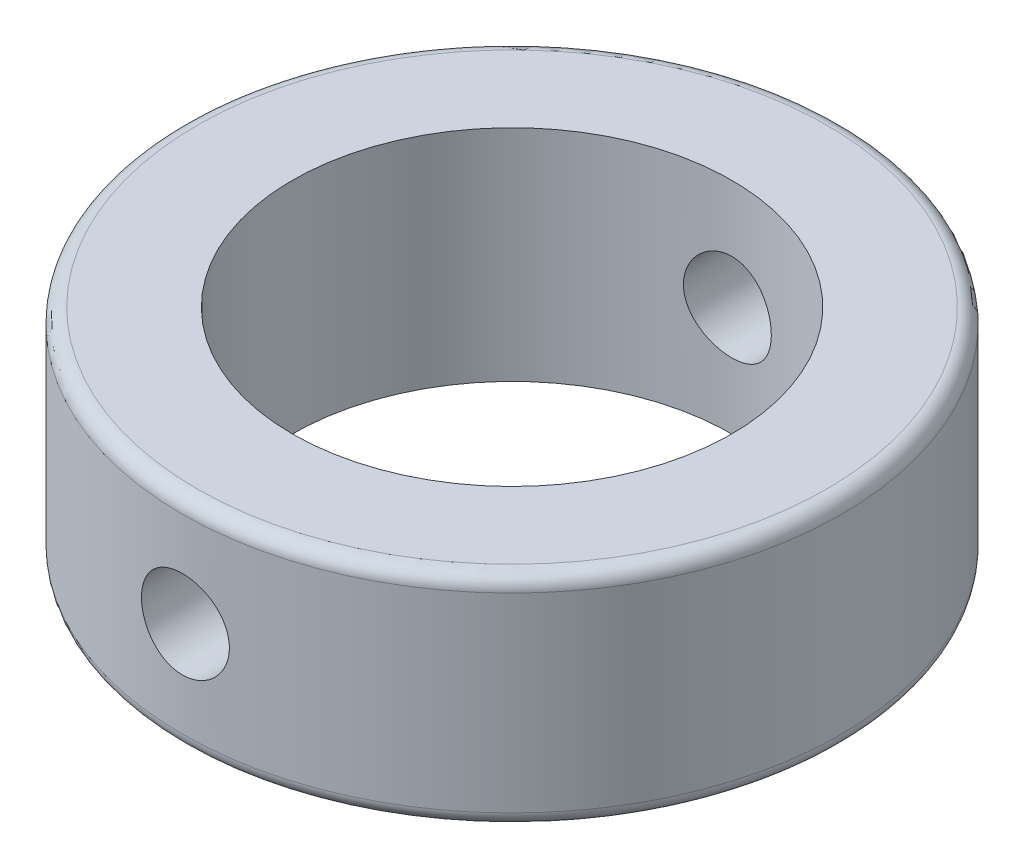
ISO-10303-21;
HEADER;
FILE_DESCRIPTION(('STEP AP214'),'2;1');
FILE_NAME('part.step','',(''),(''),'','','');
FILE_SCHEMA(('AUTOMOTIVE_DESIGN { 1 0 10303 214 1 1 1 1 }'));
ENDSEC;
DATA;
#1=APPLICATION_CONTEXT('core data for automotive mechanical design processes');
#2=APPLICATION_PROTOCOL_DEFINITION('international standard','automotive_design',2000,#1);
#3=PRODUCT_CONTEXT('',#1,'mechanical');
#4=PRODUCT('Part','Part','',(#3));
#5=PRODUCT_RELATED_PRODUCT_CATEGORY('part','',(#4));
#6=PRODUCT_DEFINITION_FORMATION('','',#4);
#7=PRODUCT_DEFINITION_CONTEXT('part definition',#1,'design');
#8=PRODUCT_DEFINITION('design','',#6,#7);
#9=PRODUCT_DEFINITION_SHAPE('','',#8);
#10=(LENGTH_UNIT() NAMED_UNIT(*) SI_UNIT(.MILLI.,.METRE.));
#11=(NAMED_UNIT(*) PLANE_ANGLE_UNIT() SI_UNIT($,.RADIAN.));
#12=(NAMED_UNIT(*) SI_UNIT($,.STERADIAN.) SOLID_ANGLE_UNIT());
#13=UNCERTAINTY_MEASURE_WITH_UNIT(LENGTH_MEASURE(1.E-05),#10,'distance_accuracy_value','');
#14=(GEOMETRIC_REPRESENTATION_CONTEXT(3) GLOBAL_UNCERTAINTY_ASSIGNED_CONTEXT((#13)) GLOBAL_UNIT_ASSIGNED_CONTEXT((#10,
#11,#12)) REPRESENTATION_CONTEXT('',''));
#15=CARTESIAN_POINT('',(0.,0.,0.));
#16=DIRECTION('',(0.,0.,1.));
#17=DIRECTION('',(1.,0.,0.));
#18=AXIS2_PLACEMENT_3D('',#15,#16,#17);
#19=CARTESIAN_POINT('',(0.,15.,0.));
#20=DIRECTION('',(0.,1.,0.));
#21=DIRECTION('',(0.,0.,1.));
#22=AXIS2_PLACEMENT_3D('',#19,#20,#21);
#23=PLANE('',#22);
#24=CARTESIAN_POINT('',(0.,15.,0.));
#25=DIRECTION('',(0.,1.,0.));
#26=DIRECTION('',(0.,0.,1.));
#27=AXIS2_PLACEMENT_3D('',#24,#25,#26);
#28=CIRCLE('',#27,21.5);
#29=CARTESIAN_POINT('',(0.,15.,21.5));
#30=VERTEX_POINT('',#29);
#31=EDGE_CURVE('E10',#30,#30,#28,.T.);
#32=ORIENTED_EDGE('',*,*,#31,.T.);
#33=EDGE_LOOP('',(#32));
#34=FACE_BOUND('',#33,.T.);
#35=CARTESIAN_POINT('',(0.,15.,0.));
#36=DIRECTION('',(0.,1.,0.));
#37=DIRECTION('',(0.,0.,1.));
#38=AXIS2_PLACEMENT_3D('',#35,#36,#37);
#39=CIRCLE('',#38,15.);
#40=CARTESIAN_POINT('',(0.,15.,15.));
#41=VERTEX_POINT('',#40);
#42=EDGE_CURVE('E51',#41,#41,#39,.T.);
#43=ORIENTED_EDGE('',*,*,#42,.F.);
#44=EDGE_LOOP('',(#43));
#45=FACE_BOUND('',#44,.T.);
#46=ADVANCED_FACE('F31',(#34,#45),#23,.T.);
#47=CARTESIAN_POINT('',(0.,0.,0.));
#48=DIRECTION('',(0.,1.,0.));
#49=DIRECTION('',(0.,0.,1.));
#50=AXIS2_PLACEMENT_3D('',#47,#48,#49);
#51=PLANE('',#50);
#52=CARTESIAN_POINT('',(0.,0.,0.));
#53=DIRECTION('',(0.,1.,0.));
#54=DIRECTION('',(0.,0.,1.));
#55=AXIS2_PLACEMENT_3D('',#52,#53,#54);
#56=CIRCLE('',#55,21.5);
#57=CARTESIAN_POINT('',(0.,0.,21.5));
#58=VERTEX_POINT('',#57);
#59=EDGE_CURVE('E38',#58,#58,#56,.F.);
#60=ORIENTED_EDGE('',*,*,#59,.T.);
#61=EDGE_LOOP('',(#60));
#62=FACE_BOUND('',#61,.T.);
#63=CARTESIAN_POINT('',(0.,0.,0.));
#64=DIRECTION('',(0.,1.,0.));
#65=DIRECTION('',(0.,0.,1.));
#66=AXIS2_PLACEMENT_3D('',#63,#64,#65);
#67=CIRCLE('',#66,15.);
#68=CARTESIAN_POINT('',(0.,0.,15.));
#69=VERTEX_POINT('',#68);
#70=EDGE_CURVE('E112',#69,#69,#67,.T.);
#71=ORIENTED_EDGE('',*,*,#70,.T.);
#72=EDGE_LOOP('',(#71));
#73=FACE_BOUND('',#72,.T.);
#74=ADVANCED_FACE('F94',(#62,#73),#51,.F.);
#75=CARTESIAN_POINT('',(0.,15.,0.));
#76=DIRECTION('',(0.,-1.,0.));
#77=DIRECTION('',(0.,0.,-1.));
#78=AXIS2_PLACEMENT_3D('',#75,#76,#77);
#79=CYLINDRICAL_SURFACE('',#78,22.5);
#80=CARTESIAN_POINT('',(0.,1.,0.));
#81=DIRECTION('',(0.,1.,0.));
#82=DIRECTION('',(0.,0.,1.));
#83=AXIS2_PLACEMENT_3D('',#80,#81,#82);
#84=CIRCLE('',#83,22.5);
#85=CARTESIAN_POINT('',(0.,1.,22.5));
#86=VERTEX_POINT('',#85);
#87=EDGE_CURVE('E42',#86,#86,#84,.T.);
#88=ORIENTED_EDGE('',*,*,#87,.T.);
#89=EDGE_LOOP('',(#88));
#90=FACE_BOUND('',#89,.T.);
#91=CARTESIAN_POINT('',(0.,14.,0.));
#92=DIRECTION('',(0.,1.,0.));
#93=DIRECTION('',(0.,0.,1.));
#94=AXIS2_PLACEMENT_3D('',#91,#92,#93);
#95=CIRCLE('',#94,22.5);
#96=CARTESIAN_POINT('',(0.,14.,22.5));
#97=VERTEX_POINT('',#96);
#98=EDGE_CURVE('E46',#97,#97,#95,.F.);
#99=ORIENTED_EDGE('',*,*,#98,.T.);
#100=EDGE_LOOP('',(#99));
#101=FACE_BOUND('',#100,.T.);
#102=CARTESIAN_POINT('',(0.,10.5,-22.5));
#103=CARTESIAN_POINT('',(-0.167713253503927,10.4999929354396,-22.4999975361382));
#104=CARTESIAN_POINT('',(-0.33552896891442,10.4858886930563,-22.4981050609079));
#105=CARTESIAN_POINT('',(-0.666484087707119,10.4298504764257,-22.4907376669036));
#106=CARTESIAN_POINT('',(-0.829618533499555,10.3878880576543,-22.4852590866258));
#107=CARTESIAN_POINT('',(-1.14637246894048,10.2773974236878,-22.471336197736));
#108=CARTESIAN_POINT('',(-1.29999852458774,10.2088877834423,-22.4628939631646));
#109=CARTESIAN_POINT('',(-1.59354584254545,10.0472896292906,-22.4439807999059));
#110=CARTESIAN_POINT('',(-1.73346930950554,9.95420507825031,-22.4335101983785));
#111=CARTESIAN_POINT('',(-1.99653873375702,9.74548010759372,-22.4116349218495));
#112=CARTESIAN_POINT('',(-2.1195869782438,9.62971703248729,-22.4002253724317));
#113=CARTESIAN_POINT('',(-2.34457103509653,9.37918471638502,-22.3777970633693));
#114=CARTESIAN_POINT('',(-2.44650572995832,9.24441447000629,-22.3667783244351));
#115=CARTESIAN_POINT('',(-2.62673853403361,8.95905131558245,-22.3463315316028));
#116=CARTESIAN_POINT('',(-2.70494411223867,8.80839947628206,-22.3369097664864));
#117=CARTESIAN_POINT('',(-2.83490767510935,8.49595339914482,-22.3207888106885));
#118=CARTESIAN_POINT('',(-2.88666679867917,8.33415964147003,-22.3140895027681));
#119=CARTESIAN_POINT('',(-2.96196910158261,8.00504128424751,-22.30421904853));
#120=CARTESIAN_POINT('',(-2.9856780634276,7.83775524820062,-22.301027180552));
#121=CARTESIAN_POINT('',(-3.00472020822176,7.50155073059107,-22.2984697741397));
#122=CARTESIAN_POINT('',(-3.00005468450402,7.33263232378365,-22.299104061306));
#123=CARTESIAN_POINT('',(-2.96261618908852,6.9991183049581,-22.3041083365948));
#124=CARTESIAN_POINT('',(-2.93002646297642,6.83450170517144,-22.3084539693351));
#125=CARTESIAN_POINT('',(-2.83795086951557,6.51309474485986,-22.3203532916212));
#126=CARTESIAN_POINT('',(-2.77846438892186,6.35630456286748,-22.3279070543119));
#127=CARTESIAN_POINT('',(-2.63408893714787,6.0544355479392,-22.3453989166654));
#128=CARTESIAN_POINT('',(-2.54912096870624,5.90939494320854,-22.3553444118585));
#129=CARTESIAN_POINT('',(-2.35625090016434,5.63556137712351,-22.376493543299));
#130=CARTESIAN_POINT('',(-2.24834760753577,5.50676926116875,-22.3876972449529));
#131=CARTESIAN_POINT('',(-2.01165735039543,5.26802548112715,-22.4102084885038));
#132=CARTESIAN_POINT('',(-1.88271256053967,5.15823023594651,-22.421516153118));
#133=CARTESIAN_POINT('',(-1.60814125520011,4.96181693260741,-22.4428788572739));
#134=CARTESIAN_POINT('',(-1.46251469166355,4.87519894121472,-22.4529338932073));
#135=CARTESIAN_POINT('',(-1.1585883295957,4.72759632345789,-22.4706659061537));
#136=CARTESIAN_POINT('',(-1.00028336826184,4.66662220343053,-22.4783419081343));
#137=CARTESIAN_POINT('',(-0.675556386504371,4.57216602154148,-22.4904423885611));
#138=CARTESIAN_POINT('',(-0.509134799313383,4.53868249404091,-22.4948670403489));
#139=CARTESIAN_POINT('',(-0.174250354988463,4.50036235084332,-22.4999436206528));
#140=CARTESIAN_POINT('',(-0.00581255182056085,4.49531039732477,-22.5006239077357));
#141=CARTESIAN_POINT('',(0.329507425828079,4.51342749619077,-22.4982118730778));
#142=CARTESIAN_POINT('',(0.496389638018499,4.53659586267354,-22.495119643029));
#143=CARTESIAN_POINT('',(0.82322057335941,4.61031698007598,-22.4855276303715));
#144=CARTESIAN_POINT('',(0.983193024768071,4.66076635248323,-22.4790407145438));
#145=CARTESIAN_POINT('',(1.29240764819034,4.78750944890563,-22.4633851388143));
#146=CARTESIAN_POINT('',(1.44164941052346,4.86380415901988,-22.4542163765916));
#147=CARTESIAN_POINT('',(1.72612331792412,5.04058823337497,-22.4341475605511));
#148=CARTESIAN_POINT('',(1.86126872159491,5.14121604857,-22.4232377256857));
#149=CARTESIAN_POINT('',(2.11282942048785,5.36361499383638,-22.4009359306497));
#150=CARTESIAN_POINT('',(2.22924386493568,5.48538708377465,-22.3895439486093));
#151=CARTESIAN_POINT('',(2.44080824134647,5.74756971395933,-22.3674735371027));
#152=CARTESIAN_POINT('',(2.53581491413408,5.88809635010724,-22.3568002316295));
#153=CARTESIAN_POINT('',(2.70087526618221,6.18323911542139,-22.3374619950273));
#154=CARTESIAN_POINT('',(2.7709295026552,6.33785492986557,-22.3287970190518));
#155=CARTESIAN_POINT('',(2.88386754751119,6.65633586304154,-22.3144921767012));
#156=CARTESIAN_POINT('',(2.92683043270193,6.82017252781621,-22.308843513489));
#157=CARTESIAN_POINT('',(2.98462000715938,7.15281544819314,-22.3011862304744));
#158=CARTESIAN_POINT('',(2.99944820140173,7.32162143748666,-22.2991774159701));
#159=CARTESIAN_POINT('',(3.00051728709284,7.65798523628026,-22.2990334694317));
#160=CARTESIAN_POINT('',(2.98698328791739,7.82554236144637,-22.3008678342378));
#161=CARTESIAN_POINT('',(2.93219065030034,8.15597681265581,-22.308137758113));
#162=CARTESIAN_POINT('',(2.89093202224903,8.31885414045297,-22.3135733158325));
#163=CARTESIAN_POINT('',(2.78193465498311,8.63526552487738,-22.3274233540915));
#164=CARTESIAN_POINT('',(2.71420831228562,8.78880391667529,-22.335836439891));
#165=CARTESIAN_POINT('',(2.55422014139606,9.08237382573909,-22.3546956856923));
#166=CARTESIAN_POINT('',(2.46195783945643,9.22240508213407,-22.365141884949));
#167=CARTESIAN_POINT('',(2.25468672764262,9.48613447489262,-22.3869895077459));
#168=CARTESIAN_POINT('',(2.13951040840351,9.6097004216327,-22.3983975863112));
#169=CARTESIAN_POINT('',(1.89003254024735,9.83583482454232,-22.4208257850249));
#170=CARTESIAN_POINT('',(1.75572651109466,9.93839834812538,-22.4318458135347));
#171=CARTESIAN_POINT('',(1.47112948177923,10.1200007076998,-22.4523095270629));
#172=CARTESIAN_POINT('',(1.32077193111595,10.1989359998329,-22.4617461964033));
#173=CARTESIAN_POINT('',(1.00888861438099,10.3303208978176,-22.4779098098846));
#174=CARTESIAN_POINT('',(0.847375018454831,10.3827988629373,-22.4846396538647));
#175=CARTESIAN_POINT('',(0.570882612147626,10.4474220095778,-22.493035826149));
#176=CARTESIAN_POINT('',(0.457636622933666,10.4671098652855,-22.4956344545261));
#177=CARTESIAN_POINT('',(0.229609757424167,10.4934012212482,-22.4991173773616));
#178=CARTESIAN_POINT('',(0.11482889467686,10.5000048369204,-22.500001686942));
#179=CARTESIAN_POINT('',(0.,10.5,-22.5));
#180=B_SPLINE_CURVE_WITH_KNOTS('',3,(#102,#103,#104,#105,#106,#107,#108,#109,#110,#111,#112,
#113,#114,#115,#116,#117,#118,#119,#120,#121,#122,#123,#124,#125,#126,#127,#128,#129,#130,#131,
#132,#133,#134,#135,#136,#137,#138,#139,#140,#141,#142,#143,#144,#145,#146,#147,#148,#149,#150,
#151,#152,#153,#154,#155,#156,#157,#158,#159,#160,#161,#162,#163,#164,#165,#166,#167,#168,#169,
#170,#171,#172,#173,#174,#175,#176,#177,#178,#179),.UNSPECIFIED.,.T.,.F.,(4,2,2,2,2,2,2,2,2,2,2,
2,2,2,2,2,2,2,2,2,2,2,2,2,2,2,2,2,2,2,2,2,2,2,2,2,2,2,4),(0.,0.502720276958616,1.00595464632757,
1.50883753924111,2.01163938846052,2.51723967665338,3.02286671857254,3.53044082267472,
4.03799306649307,4.54253033871538,5.0470446138738,5.54827327647066,6.04951336763776,
6.55232374706847,7.05516027665696,7.56195816727274,8.06875751778444,8.57576430303808,
9.08274405587615,9.58587877488092,10.0890012653172,10.590230450947,11.0914787625532,
11.5956491215483,12.0998423738814,12.6073155680318,13.1147774290957,13.6207511210318,
14.1266977467545,14.6286439124494,15.1305898900312,15.6323010555393,16.1340219089385,
16.6395550175266,17.1452067187674,17.6530429001177,18.1603335748863,18.5045360857096,
18.8487355602816),.UNSPECIFIED.);
#181=CARTESIAN_POINT('',(0.,10.5,-22.5));
#182=VERTEX_POINT('',#181);
#183=EDGE_CURVE('E85',#182,#182,#180,.T.);
#184=ORIENTED_EDGE('',*,*,#183,.T.);
#185=EDGE_LOOP('',(#184));
#186=FACE_BOUND('',#185,.T.);
#187=CARTESIAN_POINT('',(3.,7.5,22.2991031209778));
#188=CARTESIAN_POINT('',(2.99999292892183,7.33229421679777,22.2991056676806));
#189=CARTESIAN_POINT('',(2.98588990056203,7.16448595032542,22.3010154696116));
#190=CARTESIAN_POINT('',(2.92985694399183,6.83354630649642,22.3084447289533));
#191=CARTESIAN_POINT('',(2.88789854473666,6.67041989262426,22.3139678794925));
#192=CARTESIAN_POINT('',(2.77741966710399,6.35368294766046,22.3279873821811));
#193=CARTESIAN_POINT('',(2.70891795412568,6.20006578257344,22.3364816334313));
#194=CARTESIAN_POINT('',(2.54733847321029,5.90653338643568,22.3554837337772));
#195=CARTESIAN_POINT('',(2.45426464895203,5.76661596159296,22.3659912596801));
#196=CARTESIAN_POINT('',(2.24555055734277,5.50353981799729,22.3879106598111));
#197=CARTESIAN_POINT('',(2.12978523412289,5.38048070148092,22.399327327406));
#198=CARTESIAN_POINT('',(1.87924384308915,5.15547563181543,22.4217356438735));
#199=CARTESIAN_POINT('',(1.74446679970797,5.05353076278571,22.4327272708986));
#200=CARTESIAN_POINT('',(1.45909758739142,4.87328723742539,22.4530964964055));
#201=CARTESIAN_POINT('',(1.30844765656683,4.79507926606463,22.4624678475342));
#202=CARTESIAN_POINT('',(0.996005724056051,4.6651107537288,22.4784878012371));
#203=CARTESIAN_POINT('',(0.834214190883602,4.61334910143348,22.4851365182189));
#204=CARTESIAN_POINT('',(0.505103062521135,4.5380416356296,22.4949282929341));
#205=CARTESIAN_POINT('',(0.337822085204847,4.51432977748206,22.4980919730761));
#206=CARTESIAN_POINT('',(0.00162750345548496,4.49528008689477,22.5006277195727));
#207=CARTESIAN_POINT('',(-0.167286028083699,4.49994099339522,22.4999999544424));
#208=CARTESIAN_POINT('',(-0.500820186698653,4.53737209581142,22.4950401617536));
#209=CARTESIAN_POINT('',(-0.665461256042676,4.56996369711847,22.4907316700671));
#210=CARTESIAN_POINT('',(-0.986916184068831,4.66205149053226,22.4789208613843));
#211=CARTESIAN_POINT('',(-1.14372987681276,4.72154825275217,22.4714184767105));
#212=CARTESIAN_POINT('',(-1.44562771263619,4.86594516168273,22.4540222850625));
#213=CARTESIAN_POINT('',(-1.59067477402989,4.95092193477462,22.4441212821882));
#214=CARTESIAN_POINT('',(-1.86451753610218,5.14381088592428,22.4230342562856));
#215=CARTESIAN_POINT('',(-1.99331238880023,5.2517242599417,22.4118481662643));
#216=CARTESIAN_POINT('',(-2.23204509231808,5.4884217725384,22.3893388214349));
#217=CARTESIAN_POINT('',(-2.34182855029532,5.61736165229045,22.378015176366));
#218=CARTESIAN_POINT('',(-2.53822039585787,5.89191889705886,22.3565924815386));
#219=CARTESIAN_POINT('',(-2.6248286915453,6.03753632820445,22.3464934366361));
#220=CARTESIAN_POINT('',(-2.7724242912975,6.34146000052005,22.3286636450151));
#221=CARTESIAN_POINT('',(-2.8333981336006,6.49977285677773,22.3209341432218));
#222=CARTESIAN_POINT('',(-2.92785135067386,6.82451703095756,22.3087421319858));
#223=CARTESIAN_POINT('',(-2.96133224031215,6.99094790103985,22.3042794425424));
#224=CARTESIAN_POINT('',(-2.99964241153091,7.32583700250744,22.2991596751552));
#225=CARTESIAN_POINT('',(-3.00468946648218,7.4942698954988,22.2984736726744));
#226=CARTESIAN_POINT('',(-2.98656432283194,7.82957888415711,22.3009083644505));
#227=CARTESIAN_POINT('',(-2.96339281094665,7.99645501760918,22.3040289660712));
#228=CARTESIAN_POINT('',(-2.88967207555529,8.32325397960842,22.3136988065515));
#229=CARTESIAN_POINT('',(-2.8392292548504,8.48320123952716,22.3202347168148));
#230=CARTESIAN_POINT('',(-2.71250767620188,8.79236837017866,22.3359878852161));
#231=CARTESIAN_POINT('',(-2.63622789314074,8.94158781498558,22.3452052497426));
#232=CARTESIAN_POINT('',(-2.45946609625816,9.22604596566122,22.3653516992928));
#233=CARTESIAN_POINT('',(-2.3588418474945,9.36119557255235,22.376290706837));
#234=CARTESIAN_POINT('',(-2.13644748469198,9.61276640765563,22.3986171527477));
#235=CARTESIAN_POINT('',(-2.01467643215631,9.72918680422202,22.410004610999));
#236=CARTESIAN_POINT('',(-1.75249132253736,9.94076483088168,22.43203422983));
#237=CARTESIAN_POINT('',(-1.61196096139879,10.0357789745574,22.4426710507457));
#238=CARTESIAN_POINT('',(-1.31680867847643,10.200852423263,22.4619201221745));
#239=CARTESIAN_POINT('',(-1.16218707377055,10.2709122896342,22.4705324182274));
#240=CARTESIAN_POINT('',(-0.84370915878515,10.3838538923822,22.4847384703673));
#241=CARTESIAN_POINT('',(-0.679882176371044,10.4268171436253,22.4903412723117));
#242=CARTESIAN_POINT('',(-0.347259740134797,10.4846107281915,22.4979347502993));
#243=CARTESIAN_POINT('',(-0.178464543299732,10.4994425140616,22.499925612842));
#244=CARTESIAN_POINT('',(0.15790481056738,10.5005224008605,22.5000697087261));
#245=CARTESIAN_POINT('',(0.325478288882809,10.4869912058916,22.4982525737009));
#246=CARTESIAN_POINT('',(0.65594616457854,10.432198438152,22.4910439982984));
#247=CARTESIAN_POINT('',(0.818840568511611,10.390936904218,22.485652562927));
#248=CARTESIAN_POINT('',(1.13528735188325,10.2819269293851,22.4718983496352));
#249=CARTESIAN_POINT('',(1.28884395231572,10.2141905603882,22.4635369261179));
#250=CARTESIAN_POINT('',(1.58244611794646,10.0541766755311,22.4447662409466));
#251=CARTESIAN_POINT('',(1.72249143359931,9.96189870652016,22.4343569414803));
#252=CARTESIAN_POINT('',(1.98622092909954,9.75460997699573,22.4125543681221));
#253=CARTESIAN_POINT('',(2.10977573574388,9.63943531479568,22.4011543544026));
#254=CARTESIAN_POINT('',(2.33588843381036,9.38996539642449,22.3787079735476));
#255=CARTESIAN_POINT('',(2.43844136296137,9.25566563410142,22.3676616905097));
#256=CARTESIAN_POINT('',(2.62003186467116,8.97107408765783,22.3471216479154));
#257=CARTESIAN_POINT('',(2.69896410641011,8.82071461279206,22.337634925064));
#258=CARTESIAN_POINT('',(2.83034277419568,8.50882729878187,22.3213704974611));
#259=CARTESIAN_POINT('',(2.88281759498929,8.34731164537562,22.3145898900774));
#260=CARTESIAN_POINT('',(2.94743220568238,8.07082758190417,22.3061270075485));
#261=CARTESIAN_POINT('',(2.96711622203802,7.95759259054575,22.3035064293224));
#262=CARTESIAN_POINT('',(2.99340248014674,7.72958773579628,22.2999936221278));
#263=CARTESIAN_POINT('',(3.00000484113448,7.61481788640452,22.2991013774062));
#264=CARTESIAN_POINT('',(3.,7.5,22.2991031209778));
#265=B_SPLINE_CURVE_WITH_KNOTS('',3,(#187,#188,#189,#190,#191,#192,#193,#194,#195,#196,#197,
#198,#199,#200,#201,#202,#203,#204,#205,#206,#207,#208,#209,#210,#211,#212,#213,#214,#215,#216,
#217,#218,#219,#220,#221,#222,#223,#224,#225,#226,#227,#228,#229,#230,#231,#232,#233,#234,#235,
#236,#237,#238,#239,#240,#241,#242,#243,#244,#245,#246,#247,#248,#249,#250,#251,#252,#253,#254,
#255,#256,#257,#258,#259,#260,#261,#262,#263,#264),.UNSPECIFIED.,.T.,.F.,(4,2,2,2,2,2,2,2,2,2,2,
2,2,2,2,2,2,2,2,2,2,2,2,2,2,2,2,2,2,2,2,2,2,2,2,2,2,2,4),(0.,0.502697833875673,1.00591026915852,
1.50876759415237,2.01154426252434,2.51717392681748,3.02282954643357,3.5303933478772,
4.03793581885392,4.54245854287453,5.04695884297284,5.54825713004929,6.04956604000018,
6.55239792684377,7.05525603876943,7.56202372603438,8.06879342278637,8.57582891483611,
9.08283646723653,9.58595553872895,10.0890623667531,10.5902202722789,11.0913980642731,
11.595577922135,12.0997801612593,12.6072676764676,13.1147437751273,13.620685856555,
14.1266018133322,14.6285956478445,15.1305887793096,15.6323532802529,16.1341270467162,
16.6396311355341,17.145254526141,17.6531001297407,18.1603995347189,18.5045691141841,
18.8487355566505),.UNSPECIFIED.);
#266=CARTESIAN_POINT('',(3.,7.5,22.2991031209778));
#267=VERTEX_POINT('',#266);
#268=EDGE_CURVE('E60',#267,#267,#265,.T.);
#269=ORIENTED_EDGE('',*,*,#268,.T.);
#270=EDGE_LOOP('',(#269));
#271=FACE_BOUND('',#270,.T.);
#272=ADVANCED_FACE('F90',(#90,#101,#186,#271),#79,.T.);
#273=CARTESIAN_POINT('',(0.,15.,0.));
#274=DIRECTION('',(0.,-1.,0.));
#275=DIRECTION('',(0.,0.,-1.));
#276=AXIS2_PLACEMENT_3D('',#273,#274,#275);
#277=CYLINDRICAL_SURFACE('',#276,15.);
#278=CARTESIAN_POINT('',(0.,10.5,-15.));
#279=CARTESIAN_POINT('',(-0.1667307203779,10.499993866505,-14.9999969274261));
#280=CARTESIAN_POINT('',(-0.333538980604567,10.4860534710971,-14.9971915553469));
#281=CARTESIAN_POINT('',(-0.662440523067058,10.4307044996543,-14.9862709686969));
#282=CARTESIAN_POINT('',(-0.824529952624068,10.3892741015955,-14.9781515358056));
#283=CARTESIAN_POINT('',(-1.13919091578994,10.2802761791376,-14.9575094783486));
#284=CARTESIAN_POINT('',(-1.2917714037994,10.2127336894659,-14.9449910723015));
#285=CARTESIAN_POINT('',(-1.58342396659268,10.0535032574661,-14.9169119410594));
#286=CARTESIAN_POINT('',(-1.72249684522744,9.96181675317838,-14.9013513970712));
#287=CARTESIAN_POINT('',(-1.9850804319446,9.7555845171257,-14.8686649598991));
#288=CARTESIAN_POINT('',(-2.10838185347557,9.64077493382639,-14.8515223651304));
#289=CARTESIAN_POINT('',(-2.33411026982409,9.39212275082489,-14.8177254135776));
#290=CARTESIAN_POINT('',(-2.43653563431127,9.25827866599464,-14.8010710950127));
#291=CARTESIAN_POINT('',(-2.61849526004286,8.97385142096437,-14.7699732543785));
#292=CARTESIAN_POINT('',(-2.6978128165976,8.82312706861092,-14.7555512209484));
#293=CARTESIAN_POINT('',(-2.82991699974092,8.51015454298776,-14.7307880417525));
#294=CARTESIAN_POINT('',(-2.88270624731171,8.34790750996097,-14.7204464928588));
#295=CARTESIAN_POINT('',(-2.95957589965448,8.01874690827625,-14.7051841575661));
#296=CARTESIAN_POINT('',(-2.98402349387633,7.85192236757332,-14.7001941032156));
#297=CARTESIAN_POINT('',(-3.00465638317836,7.51647053590697,-14.6959912518188));
#298=CARTESIAN_POINT('',(-3.0008445681405,7.34784343103956,-14.6967778640352));
#299=CARTESIAN_POINT('',(-2.96536371930546,7.01625963593699,-14.7039765344455));
#300=CARTESIAN_POINT('',(-2.93411562073172,6.85325578311806,-14.7103035857629));
#301=CARTESIAN_POINT('',(-2.84531365386915,6.53485177001099,-14.7277363848));
#302=CARTESIAN_POINT('',(-2.78775852930204,6.37945197324298,-14.7388423607334));
#303=CARTESIAN_POINT('',(-2.64757435102416,6.0794542148892,-14.7646685550122));
#304=CARTESIAN_POINT('',(-2.56477845369634,5.93493636129248,-14.7794126944111));
#305=CARTESIAN_POINT('',(-2.37658072371804,5.66168745008156,-14.8108385631919));
#306=CARTESIAN_POINT('',(-2.27117629307049,5.53295820944653,-14.827520515151));
#307=CARTESIAN_POINT('',(-2.03849980368175,5.29251179262919,-14.8613106372439));
#308=CARTESIAN_POINT('',(-1.91086848363733,5.18114229642261,-14.8784210763271));
#309=CARTESIAN_POINT('',(-1.63855507218603,4.98133846109633,-14.9108654614323));
#310=CARTESIAN_POINT('',(-1.49387276213817,4.89290441611926,-14.9261993846692));
#311=CARTESIAN_POINT('',(-1.19117816063676,4.74141747232207,-14.9534007048266));
#312=CARTESIAN_POINT('',(-1.0331454587559,4.67840431906639,-14.9652626654482));
#313=CARTESIAN_POINT('',(-0.708446929345994,4.5799185778843,-14.9841422696357));
#314=CARTESIAN_POINT('',(-0.541782150217349,4.54444265377912,-14.9911605000159));
#315=CARTESIAN_POINT('',(-0.207538216881452,4.50253063861717,-14.999480156006));
#316=CARTESIAN_POINT('',(-0.0400209849767291,4.49561874137919,-15.0008752395741));
#317=CARTESIAN_POINT('',(0.293774802578142,4.50974957682654,-14.9980515579031));
#318=CARTESIAN_POINT('',(0.460053427331379,4.53079073805779,-14.9938331082434));
#319=CARTESIAN_POINT('',(0.785116979839622,4.59983512063187,-14.9803149602405));
#320=CARTESIAN_POINT('',(0.943955845019709,4.64759420549371,-14.9710612921262));
#321=CARTESIAN_POINT('',(1.251370882499,4.76845194796743,-14.948506561831));
#322=CARTESIAN_POINT('',(1.39994628491262,4.84155250403049,-14.9352051964268));
#323=CARTESIAN_POINT('',(1.68462352105865,5.01204747195394,-14.9057973459988));
#324=CARTESIAN_POINT('',(1.82055038025656,5.10972834311683,-14.8896585131116));
#325=CARTESIAN_POINT('',(2.07425405735762,5.32622757362184,-14.8564420448965));
#326=CARTESIAN_POINT('',(2.19202892679229,5.4450481991996,-14.8393643090516));
#327=CARTESIAN_POINT('',(2.40792177232253,5.70262005567337,-14.8058791067089));
#328=CARTESIAN_POINT('',(2.50571310734597,5.84164723266401,-14.7894858069991));
#329=CARTESIAN_POINT('',(2.67655626015362,6.13443408407004,-14.7595257538858));
#330=CARTESIAN_POINT('',(2.74960906776871,6.28819316872066,-14.7459588874003));
#331=CARTESIAN_POINT('',(2.86845552474588,6.60530473844864,-14.7233022175315));
#332=CARTESIAN_POINT('',(2.91439049937315,6.76860252363096,-14.7141892461656));
#333=CARTESIAN_POINT('',(2.97812595488159,7.10080036047271,-14.7014231037608));
#334=CARTESIAN_POINT('',(2.99593010467534,7.26969967862804,-14.6977692207333));
#335=CARTESIAN_POINT('',(3.00276273260241,7.60502659363295,-14.6963744889414));
#336=CARTESIAN_POINT('',(2.99230736421269,7.77144344678103,-14.698527575679));
#337=CARTESIAN_POINT('',(2.94405691230018,8.10009494971508,-14.7082672045384));
#338=CARTESIAN_POINT('',(2.90626204838789,8.26232963308441,-14.7158537030151));
#339=CARTESIAN_POINT('',(2.80463570549686,8.57768313372163,-14.7355579265748));
#340=CARTESIAN_POINT('',(2.74086752015203,8.73082308150725,-14.7476646305649));
#341=CARTESIAN_POINT('',(2.58916393380481,9.02431116220332,-14.7750514492251));
#342=CARTESIAN_POINT('',(2.50122650632465,9.16465822117541,-14.7903318299668));
#343=CARTESIAN_POINT('',(2.30191774435924,9.43114671645094,-14.8226688156968));
#344=CARTESIAN_POINT('',(2.19017366170554,9.55700629580279,-14.839751187291));
#345=CARTESIAN_POINT('',(1.94719310703942,9.78835861658751,-14.8735824561586));
#346=CARTESIAN_POINT('',(1.81595216146,9.89384667095182,-14.8903312758955));
#347=CARTESIAN_POINT('',(1.53605288726474,10.0825039318393,-14.9218149716391));
#348=CARTESIAN_POINT('',(1.3872266532895,10.1654280098401,-14.9365269365774));
#349=CARTESIAN_POINT('',(1.0774990828222,10.3049583677898,-14.96205375255));
#350=CARTESIAN_POINT('',(0.916608782589378,10.3615883685975,-14.9728721141585));
#351=CARTESIAN_POINT('',(0.629464466771339,10.4359558441341,-14.9872911778611));
#352=CARTESIAN_POINT('',(0.504844992041354,10.4599295811233,-14.9920290947535));
#353=CARTESIAN_POINT('',(0.253498575630201,10.4919537370751,-14.9983846241968));
#354=CARTESIAN_POINT('',(0.126771701245857,10.5000046635293,-15.0000023361946));
#355=CARTESIAN_POINT('',(0.,10.5,-15.));
#356=B_SPLINE_CURVE_WITH_KNOTS('',3,(#278,#279,#280,#281,#282,#283,#284,#285,#286,#287,#288,
#289,#290,#291,#292,#293,#294,#295,#296,#297,#298,#299,#300,#301,#302,#303,#304,#305,#306,#307,
#308,#309,#310,#311,#312,#313,#314,#315,#316,#317,#318,#319,#320,#321,#322,#323,#324,#325,#326,
#327,#328,#329,#330,#331,#332,#333,#334,#335,#336,#337,#338,#339,#340,#341,#342,#343,#344,#345,
#346,#347,#348,#349,#350,#351,#352,#353,#354,#355),.UNSPECIFIED.,.T.,.F.,(4,2,2,2,2,2,2,2,2,2,2,
2,2,2,2,2,2,2,2,2,2,2,2,2,2,2,2,2,2,2,2,2,2,2,2,2,2,2,4),(0.,0.499728391983775,0.99985395207397,
1.49950120575103,1.99911870669259,2.50479801033656,3.0105167902421,3.52083585017768,
4.03110448095592,4.53468555310762,5.03821512843675,5.53415181018835,6.03011217761189,
6.52942470610778,7.02879464249011,7.53714757474052,8.04550702619461,8.55465824562072,
9.06374777094108,9.56432207028795,10.064868229736,10.5609136185217,11.0569961764807,
11.5591519810008,12.0613616503779,12.5712188573768,13.081055661704,13.5882114309817,
14.0953010499124,14.593191677031,15.0910783047782,15.5877588375933,16.084481027456,
16.5896422871743,17.0949196359879,17.6054849002691,18.1155886655256,18.4955632586968,
18.8755257411299),.UNSPECIFIED.);
#357=CARTESIAN_POINT('',(0.,10.5,-15.));
#358=VERTEX_POINT('',#357);
#359=EDGE_CURVE('E52',#358,#358,#356,.T.);
#360=ORIENTED_EDGE('',*,*,#359,.F.);
#361=EDGE_LOOP('',(#360));
#362=FACE_BOUND('',#361,.T.);
#363=CARTESIAN_POINT('',(3.,7.5,14.6969384566991));
#364=CARTESIAN_POINT('',(2.99999383762581,7.33330687352653,14.6969417707994));
#365=CARTESIAN_POINT('',(2.98605951515443,7.16653612999998,14.6998052480611));
#366=CARTESIAN_POINT('',(2.93073685074852,6.8377124845706,14.7109329391462));
#367=CARTESIAN_POINT('',(2.88932654121148,6.67566346609206,14.7192014743436));
#368=CARTESIAN_POINT('',(2.78038734785924,6.36108808993737,14.7401662116556));
#369=CARTESIAN_POINT('',(2.71288444245786,6.20855243540223,14.7528580086323));
#370=CARTESIAN_POINT('',(2.55374732301151,5.91697546590913,14.7812339844198));
#371=CARTESIAN_POINT('',(2.46211445580345,5.77793339838629,14.7969179962038));
#372=CARTESIAN_POINT('',(2.25593722696031,5.51531698843842,14.8297589908276));
#373=CARTESIAN_POINT('',(2.14111696773996,5.39196123634808,14.8469321351174));
#374=CARTESIAN_POINT('',(1.89242036706393,5.16612739926306,14.880674169078));
#375=CARTESIAN_POINT('',(1.75854269093395,5.06365077774842,14.8972430163249));
#376=CARTESIAN_POINT('',(1.47408406777277,4.88163594711462,14.9280838925269));
#377=CARTESIAN_POINT('',(1.32336770301663,4.80230545855008,14.9423346432465));
#378=CARTESIAN_POINT('',(1.01041245116182,4.67017518885559,14.9667521065089));
#379=CARTESIAN_POINT('',(0.848174644261661,4.61737292429703,14.9769192013236));
#380=CARTESIAN_POINT('',(0.519050319835485,4.54047841914113,14.9919096206526));
#381=CARTESIAN_POINT('',(0.352253217644444,4.51601706728698,14.9968015886438));
#382=CARTESIAN_POINT('',(0.0168557053126107,4.49534714448505,15.0009276355081));
#383=CARTESIAN_POINT('',(-0.151744529495528,4.49913585106253,15.0001622595828));
#384=CARTESIAN_POINT('',(-0.483426002230764,4.53457854064666,14.9931130460555));
#385=CARTESIAN_POINT('',(-0.646551642895408,4.56583493150354,14.9869079509751));
#386=CARTESIAN_POINT('',(-0.965194879740902,4.65469509737668,14.9697653147823));
#387=CARTESIAN_POINT('',(-1.12071217124139,4.71229992657562,14.9588275843212));
#388=CARTESIAN_POINT('',(-1.42085838960266,4.8525901204418,14.9333188805988));
#389=CARTESIAN_POINT('',(-1.5654125224017,4.93543125331466,14.9187254452567));
#390=CARTESIAN_POINT('',(-1.83871513757927,5.1237272317098,14.8875140842136));
#391=CARTESIAN_POINT('',(-1.967461798575,5.22918467931155,14.8708959256567));
#392=CARTESIAN_POINT('',(-2.20785429316037,5.46190086632542,14.8371289309338));
#393=CARTESIAN_POINT('',(-2.31916294972089,5.58950756018877,14.8199758937255));
#394=CARTESIAN_POINT('',(-2.51885547953042,5.86174932735226,14.7873471479628));
#395=CARTESIAN_POINT('',(-2.60723891918325,6.00638472264959,14.7718714711364));
#396=CARTESIAN_POINT('',(-2.75868844440564,6.30906249546542,14.7443414241877));
#397=CARTESIAN_POINT('',(-2.82169994333313,6.46713290291899,14.7322944469065));
#398=CARTESIAN_POINT('',(-2.92017102488275,6.79191397117197,14.7130942896382));
#399=CARTESIAN_POINT('',(-2.95563419836993,6.95862350285725,14.7059404718528));
#400=CARTESIAN_POINT('',(-2.99749801810815,7.29289457399713,14.6974643780348));
#401=CARTESIAN_POINT('',(-3.00438557669374,7.46039272293102,14.6960444117146));
#402=CARTESIAN_POINT('',(-2.99021288493222,7.79414466959905,14.6989345706656));
#403=CARTESIAN_POINT('',(-2.96915421936733,7.96039853735659,14.7032443710116));
#404=CARTESIAN_POINT('',(-2.90010662422247,8.28530592087671,14.7170169748474));
#405=CARTESIAN_POINT('',(-2.8523778625179,8.44401702910729,14.7264299704349));
#406=CARTESIAN_POINT('',(-2.73162310592555,8.75118983708622,14.7493046805499));
#407=CARTESIAN_POINT('',(-2.65859502711953,8.89965069130716,14.7627667285881));
#408=CARTESIAN_POINT('',(-2.4882124266468,9.18423932985048,14.7924421788612));
#409=CARTESIAN_POINT('',(-2.39055323394826,9.32018113890248,14.8086891559471));
#410=CARTESIAN_POINT('',(-2.17408671663814,9.57392493600274,14.8420117147991));
#411=CARTESIAN_POINT('',(-2.05527721543361,9.69172505474776,14.8590873817145));
#412=CARTESIAN_POINT('',(-1.79769682049367,9.90768767755673,14.8924603760765));
#413=CARTESIAN_POINT('',(-1.65864749678889,10.00552096395,14.9087417312605));
#414=CARTESIAN_POINT('',(-1.36580368990427,10.1764376444987,14.9384138288586));
#415=CARTESIAN_POINT('',(-1.21200982630052,10.2495220780343,14.9518046926563));
#416=CARTESIAN_POINT('',(-0.894908042472042,10.3683866152399,14.974118821832));
#417=CARTESIAN_POINT('',(-0.731660020434239,10.4143215546788,14.9830673742781));
#418=CARTESIAN_POINT('',(-0.399568364039739,10.4780737429915,14.9955970781298));
#419=CARTESIAN_POINT('',(-0.230725406133638,10.495894378427,14.9991788759955));
#420=CARTESIAN_POINT('',(0.104618681710861,10.5027809428887,15.0005562136234));
#421=CARTESIAN_POINT('',(0.271109436424479,10.4923418413687,14.9984513564799));
#422=CARTESIAN_POINT('',(0.599913093946948,10.4440981483565,14.9889013068102));
#423=CARTESIAN_POINT('',(0.762226049261166,10.4062939009556,14.9814561814329));
#424=CARTESIAN_POINT('',(1.07775824923519,10.3046130237252,14.9620649509476));
#425=CARTESIAN_POINT('',(1.23099732972049,10.2407958656071,14.9501291174284));
#426=CARTESIAN_POINT('',(1.52466366055821,10.0889632760067,14.9230416637104));
#427=CARTESIAN_POINT('',(1.66508989730354,10.0009459322865,14.9078897894096));
#428=CARTESIAN_POINT('',(1.93159167031775,9.80154183881615,14.8757279747022));
#429=CARTESIAN_POINT('',(2.05739914834453,9.68980099084868,14.858692002537));
#430=CARTESIAN_POINT('',(2.28864785327552,9.44684927970369,14.8248366872359));
#431=CARTESIAN_POINT('',(2.39408424962674,9.31563381156023,14.8080173963616));
#432=CARTESIAN_POINT('',(2.58267665834995,9.03576204992871,14.7763002820179));
#433=CARTESIAN_POINT('',(2.66558044385427,8.88693311663624,14.7614251071368));
#434=CARTESIAN_POINT('',(2.80507214779868,8.5772016802197,14.7355571137924));
#435=CARTESIAN_POINT('',(2.86168393792249,8.41631028393843,14.7245607757495));
#436=CARTESIAN_POINT('',(2.93600741957297,8.12921263367138,14.7098904341354));
#437=CARTESIAN_POINT('',(2.95996169557105,8.00464374145813,14.7050635474382));
#438=CARTESIAN_POINT('',(2.99196005387913,7.75339813634659,14.6985863537725));
#439=CARTESIAN_POINT('',(3.00000468468793,7.62672149626659,14.6969359372925));
#440=CARTESIAN_POINT('',(3.,7.5,14.6969384566991));
#441=B_SPLINE_CURVE_WITH_KNOTS('',3,(#363,#364,#365,#366,#367,#368,#369,#370,#371,#372,#373,
#374,#375,#376,#377,#378,#379,#380,#381,#382,#383,#384,#385,#386,#387,#388,#389,#390,#391,#392,
#393,#394,#395,#396,#397,#398,#399,#400,#401,#402,#403,#404,#405,#406,#407,#408,#409,#410,#411,
#412,#413,#414,#415,#416,#417,#418,#419,#420,#421,#422,#423,#424,#425,#426,#427,#428,#429,#430,
#431,#432,#433,#434,#435,#436,#437,#438,#439,#440),.UNSPECIFIED.,.T.,.F.,(4,2,2,2,2,2,2,2,2,2,2,
2,2,2,2,2,2,2,2,2,2,2,2,2,2,2,2,2,2,2,2,2,2,2,2,2,2,2,4),(0.,0.499615391608283,
0.999630717852889,1.49914949382176,1.99864039457959,2.5044675764531,3.01033020106266,
3.5206020131235,4.03082604739679,4.53432746649241,5.03778036348745,5.53406368900612,
6.03036687221251,6.5297977266691,7.02928607310198,7.5374804028745,8.04568434368161,
8.5549758951833,9.06420105048074,9.5647127341378,10.0651960358526,10.5608802534996,
11.0566053106319,11.5587917932356,12.0610299861063,12.5709780520035,13.0809046989031,
13.5878944073595,14.0948230407488,14.5929305224406,15.0910317410027,15.5880005122635,
16.0850085640405,16.5900345607679,17.0951801666934,17.6057669573882,18.1158892527059,
18.4957141091448,18.8755258705644),.UNSPECIFIED.);
#442=CARTESIAN_POINT('',(3.,7.5,14.6969384566991));
#443=VERTEX_POINT('',#442);
#444=EDGE_CURVE('E61',#443,#443,#441,.T.);
#445=ORIENTED_EDGE('',*,*,#444,.F.);
#446=EDGE_LOOP('',(#445));
#447=FACE_BOUND('',#446,.T.);
#448=ORIENTED_EDGE('',*,*,#42,.T.);
#449=EDGE_LOOP('',(#448));
#450=FACE_BOUND('',#449,.T.);
#451=ORIENTED_EDGE('',*,*,#70,.F.);
#452=EDGE_LOOP('',(#451));
#453=FACE_BOUND('',#452,.T.);
#454=ADVANCED_FACE('F66',(#362,#447,#450,#453),#277,.F.);
#455=CARTESIAN_POINT('',(0.,7.5,-22.5));
#456=DIRECTION('',(0.,0.,1.));
#457=DIRECTION('',(1.,0.,0.));
#458=AXIS2_PLACEMENT_3D('',#455,#456,#457);
#459=CYLINDRICAL_SURFACE('',#458,3.);
#460=ORIENTED_EDGE('',*,*,#444,.T.);
#461=EDGE_LOOP('',(#460));
#462=FACE_BOUND('',#461,.T.);
#463=ORIENTED_EDGE('',*,*,#268,.F.);
#464=EDGE_LOOP('',(#463));
#465=FACE_BOUND('',#464,.T.);
#466=ADVANCED_FACE('F73',(#462,#465),#459,.F.);
#467=ORIENTED_EDGE('',*,*,#359,.T.);
#468=EDGE_LOOP('',(#467));
#469=FACE_BOUND('',#468,.T.);
#470=ORIENTED_EDGE('',*,*,#183,.F.);
#471=EDGE_LOOP('',(#470));
#472=FACE_BOUND('',#471,.T.);
#473=ADVANCED_FACE('F69',(#469,#472),#459,.F.);
#474=CARTESIAN_POINT('',(0.,1.,0.));
#475=DIRECTION('',(0.,1.,0.));
#476=DIRECTION('',(0.,0.,1.));
#477=AXIS2_PLACEMENT_3D('',#474,#475,#476);
#478=TOROIDAL_SURFACE('',#477,21.5,1.);
#479=ORIENTED_EDGE('',*,*,#59,.F.);
#480=EDGE_LOOP('',(#479));
#481=FACE_BOUND('',#480,.T.);
#482=ORIENTED_EDGE('',*,*,#87,.F.);
#483=EDGE_LOOP('',(#482));
#484=FACE_BOUND('',#483,.T.);
#485=ADVANCED_FACE('F72',(#481,#484),#478,.T.);
#486=CARTESIAN_POINT('',(0.,14.,0.));
#487=DIRECTION('',(0.,1.,0.));
#488=DIRECTION('',(0.,0.,1.));
#489=AXIS2_PLACEMENT_3D('',#486,#487,#488);
#490=TOROIDAL_SURFACE('',#489,21.5,1.);
#491=ORIENTED_EDGE('',*,*,#98,.F.);
#492=EDGE_LOOP('',(#491));
#493=FACE_BOUND('',#492,.T.);
#494=ORIENTED_EDGE('',*,*,#31,.F.);
#495=EDGE_LOOP('',(#494));
#496=FACE_BOUND('',#495,.T.);
#497=ADVANCED_FACE('F33',(#493,#496),#490,.T.);
#498=CLOSED_SHELL('',(#46,#74,#272,#454,#466,#473,#485,#497));
#499=MANIFOLD_SOLID_BREP('B2',#498);
#500=ADVANCED_BREP_SHAPE_REPRESENTATION('',(#18,#499),#14);
#501=SHAPE_DEFINITION_REPRESENTATION(#9,#500);
ENDSEC;
END-ISO-10303-21;
